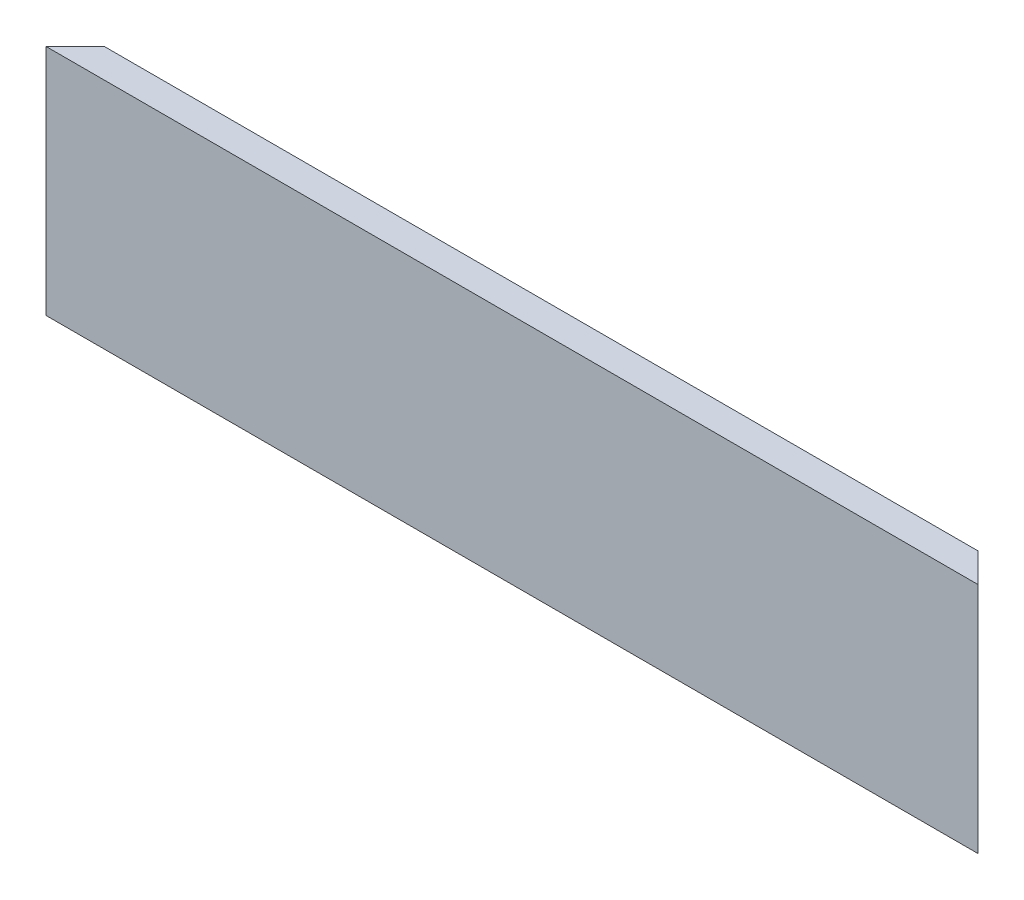
ISO-10303-21;
HEADER;
FILE_DESCRIPTION(('STEP AP214'),'2;1');
FILE_NAME('part.step','',(''),(''),'','','');
FILE_SCHEMA(('AUTOMOTIVE_DESIGN { 1 0 10303 214 1 1 1 1 }'));
ENDSEC;
DATA;
#1=APPLICATION_CONTEXT('core data for automotive mechanical design processes');
#2=APPLICATION_PROTOCOL_DEFINITION('international standard','automotive_design',2000,#1);
#3=PRODUCT_CONTEXT('',#1,'mechanical');
#4=PRODUCT('Part','Part','',(#3));
#5=PRODUCT_RELATED_PRODUCT_CATEGORY('part','',(#4));
#6=PRODUCT_DEFINITION_FORMATION('','',#4);
#7=PRODUCT_DEFINITION_CONTEXT('part definition',#1,'design');
#8=PRODUCT_DEFINITION('design','',#6,#7);
#9=PRODUCT_DEFINITION_SHAPE('','',#8);
#10=(LENGTH_UNIT() NAMED_UNIT(*) SI_UNIT(.MILLI.,.METRE.));
#11=(NAMED_UNIT(*) PLANE_ANGLE_UNIT() SI_UNIT($,.RADIAN.));
#12=(NAMED_UNIT(*) SI_UNIT($,.STERADIAN.) SOLID_ANGLE_UNIT());
#13=UNCERTAINTY_MEASURE_WITH_UNIT(LENGTH_MEASURE(1.E-05),#10,'distance_accuracy_value','');
#14=(GEOMETRIC_REPRESENTATION_CONTEXT(3) GLOBAL_UNCERTAINTY_ASSIGNED_CONTEXT((#13)) GLOBAL_UNIT_ASSIGNED_CONTEXT((#10,
#11,#12)) REPRESENTATION_CONTEXT('',''));
#15=CARTESIAN_POINT('',(0.,0.,0.));
#16=DIRECTION('',(0.,0.,1.));
#17=DIRECTION('',(1.,0.,0.));
#18=AXIS2_PLACEMENT_3D('',#15,#16,#17);
#19=CARTESIAN_POINT('',(50.8,0.,-25.4));
#20=DIRECTION('',(0.,1.,0.));
#21=DIRECTION('',(0.,0.,1.));
#22=AXIS2_PLACEMENT_3D('',#19,#20,#21);
#23=PLANE('',#22);
#24=DIRECTION('',(-1.,0.,0.));
#25=VECTOR('',#24,1.);
#26=CARTESIAN_POINT('',(50.8,0.,0.));
#27=LINE('',#26,#25);
#28=CARTESIAN_POINT('',(50.8,0.,0.));
#29=VERTEX_POINT('',#28);
#30=CARTESIAN_POINT('',(-50.8,0.,0.));
#31=VERTEX_POINT('',#30);
#32=EDGE_CURVE('E118',#29,#31,#27,.T.);
#33=ORIENTED_EDGE('',*,*,#32,.T.);
#34=DIRECTION('',(0.707106781186545,0.,-0.70710678118655));
#35=VECTOR('',#34,1.);
#36=CARTESIAN_POINT('',(12.6999999999997,0.,-63.5000000000001));
#37=LINE('',#36,#35);
#38=CARTESIAN_POINT('',(-25.4000000000002,0.,-25.4));
#39=VERTEX_POINT('',#38);
#40=EDGE_CURVE('E97',#31,#39,#37,.T.);
#41=ORIENTED_EDGE('',*,*,#40,.T.);
#42=DIRECTION('',(-1.,0.,0.));
#43=VECTOR('',#42,1.);
#44=CARTESIAN_POINT('',(50.8,0.,-25.4));
#45=LINE('',#44,#43);
#46=CARTESIAN_POINT('',(25.4000000000003,0.,-25.4));
#47=VERTEX_POINT('',#46);
#48=EDGE_CURVE('E11',#47,#39,#45,.T.);
#49=ORIENTED_EDGE('',*,*,#48,.F.);
#50=DIRECTION('',(0.707106781186544,0.,0.707106781186551));
#51=VECTOR('',#50,1.);
#52=CARTESIAN_POINT('',(38.1,0.,-12.7000000000001));
#53=LINE('',#52,#51);
#54=EDGE_CURVE('E104',#47,#29,#53,.T.);
#55=ORIENTED_EDGE('',*,*,#54,.T.);
#56=EDGE_LOOP('',(#33,#41,#49,#55));
#57=FACE_BOUND('',#56,.T.);
#58=ADVANCED_FACE('F43',(#57),#23,.F.);
#59=CARTESIAN_POINT('',(50.8,3.175,-25.4));
#60=DIRECTION('',(0.,0.,1.));
#61=DIRECTION('',(1.,0.,0.));
#62=AXIS2_PLACEMENT_3D('',#59,#60,#61);
#63=PLANE('',#62);
#64=ORIENTED_EDGE('',*,*,#48,.T.);
#65=DIRECTION('',(0.,1.,0.));
#66=VECTOR('',#65,1.);
#67=CARTESIAN_POINT('',(-25.4000000000002,-1.2E-05,-25.4));
#68=LINE('',#67,#66);
#69=CARTESIAN_POINT('',(-25.4000000000002,3.175,-25.4));
#70=VERTEX_POINT('',#69);
#71=EDGE_CURVE('E114',#39,#70,#68,.T.);
#72=ORIENTED_EDGE('',*,*,#71,.T.);
#73=DIRECTION('',(-1.,0.,0.));
#74=VECTOR('',#73,1.);
#75=CARTESIAN_POINT('',(50.8,3.175,-25.4));
#76=LINE('',#75,#74);
#77=CARTESIAN_POINT('',(25.4000000000003,3.175,-25.4));
#78=VERTEX_POINT('',#77);
#79=EDGE_CURVE('E52',#78,#70,#76,.T.);
#80=ORIENTED_EDGE('',*,*,#79,.F.);
#81=DIRECTION('',(0.,1.,0.));
#82=VECTOR('',#81,1.);
#83=CARTESIAN_POINT('',(25.4000000000003,-1.2E-05,-25.4));
#84=LINE('',#83,#82);
#85=EDGE_CURVE('E142',#47,#78,#84,.T.);
#86=ORIENTED_EDGE('',*,*,#85,.F.);
#87=EDGE_LOOP('',(#64,#72,#80,#86));
#88=FACE_BOUND('',#87,.T.);
#89=ADVANCED_FACE('F141',(#88),#63,.F.);
#90=CARTESIAN_POINT('',(50.8,3.175,-3.175));
#91=DIRECTION('',(0.,-1.,0.));
#92=DIRECTION('',(0.,0.,-1.));
#93=AXIS2_PLACEMENT_3D('',#90,#91,#92);
#94=PLANE('',#93);
#95=ORIENTED_EDGE('',*,*,#79,.T.);
#96=DIRECTION('',(-0.707106781186545,0.,0.70710678118655));
#97=VECTOR('',#96,1.);
#98=CARTESIAN_POINT('',(1.58749999999969,3.175,-52.3875));
#99=LINE('',#98,#97);
#100=CARTESIAN_POINT('',(-47.625,3.175,-3.175));
#101=VERTEX_POINT('',#100);
#102=EDGE_CURVE('E136',#70,#101,#99,.T.);
#103=ORIENTED_EDGE('',*,*,#102,.T.);
#104=DIRECTION('',(-1.,0.,0.));
#105=VECTOR('',#104,1.);
#106=CARTESIAN_POINT('',(50.8,3.175,-3.175));
#107=LINE('',#106,#105);
#108=CARTESIAN_POINT('',(47.625,3.175,-3.175));
#109=VERTEX_POINT('',#108);
#110=EDGE_CURVE('E122',#109,#101,#107,.T.);
#111=ORIENTED_EDGE('',*,*,#110,.F.);
#112=DIRECTION('',(-0.707106781186544,0.,-0.707106781186551));
#113=VECTOR('',#112,1.);
#114=CARTESIAN_POINT('',(49.2125,3.175,-1.58750000000002));
#115=LINE('',#114,#113);
#116=EDGE_CURVE('E137',#109,#78,#115,.T.);
#117=ORIENTED_EDGE('',*,*,#116,.T.);
#118=EDGE_LOOP('',(#95,#103,#111,#117));
#119=FACE_BOUND('',#118,.T.);
#120=ADVANCED_FACE('F134',(#119),#94,.F.);
#121=CARTESIAN_POINT('',(50.8,25.4,-3.175));
#122=DIRECTION('',(0.,0.,1.));
#123=DIRECTION('',(0.,-1.,0.));
#124=AXIS2_PLACEMENT_3D('',#121,#122,#123);
#125=PLANE('',#124);
#126=ORIENTED_EDGE('',*,*,#110,.T.);
#127=DIRECTION('',(0.,1.,0.));
#128=VECTOR('',#127,1.);
#129=CARTESIAN_POINT('',(-47.625,25.4,-3.175));
#130=LINE('',#129,#128);
#131=CARTESIAN_POINT('',(-47.625,25.4,-3.17500000000001));
#132=VERTEX_POINT('',#131);
#133=EDGE_CURVE('E145',#101,#132,#130,.T.);
#134=ORIENTED_EDGE('',*,*,#133,.T.);
#135=DIRECTION('',(-1.,0.,0.));
#136=VECTOR('',#135,1.);
#137=CARTESIAN_POINT('',(50.8,25.4,-3.175));
#138=LINE('',#137,#136);
#139=CARTESIAN_POINT('',(47.625,25.4,-3.17500000000001));
#140=VERTEX_POINT('',#139);
#141=EDGE_CURVE('E112',#140,#132,#138,.T.);
#142=ORIENTED_EDGE('',*,*,#141,.F.);
#143=DIRECTION('',(0.,-1.,0.));
#144=VECTOR('',#143,1.);
#145=CARTESIAN_POINT('',(47.625,25.4,-3.175));
#146=LINE('',#145,#144);
#147=EDGE_CURVE('E158',#140,#109,#146,.T.);
#148=ORIENTED_EDGE('',*,*,#147,.T.);
#149=EDGE_LOOP('',(#126,#134,#142,#148));
#150=FACE_BOUND('',#149,.T.);
#151=ADVANCED_FACE('F177',(#150),#125,.F.);
#152=CARTESIAN_POINT('',(50.8,25.4,0.));
#153=DIRECTION('',(0.,-1.,0.));
#154=DIRECTION('',(0.,0.,-1.));
#155=AXIS2_PLACEMENT_3D('',#152,#153,#154);
#156=PLANE('',#155);
#157=ORIENTED_EDGE('',*,*,#141,.T.);
#158=DIRECTION('',(0.707106781186545,0.,-0.70710678118655));
#159=VECTOR('',#158,1.);
#160=CARTESIAN_POINT('',(-50.8,25.4,0.));
#161=LINE('',#160,#159);
#162=CARTESIAN_POINT('',(-50.8,25.4,0.));
#163=VERTEX_POINT('',#162);
#164=EDGE_CURVE('E94',#163,#132,#161,.T.);
#165=ORIENTED_EDGE('',*,*,#164,.F.);
#166=DIRECTION('',(-1.,0.,0.));
#167=VECTOR('',#166,1.);
#168=CARTESIAN_POINT('',(50.8,25.4,0.));
#169=LINE('',#168,#167);
#170=CARTESIAN_POINT('',(50.8,25.4,0.));
#171=VERTEX_POINT('',#170);
#172=EDGE_CURVE('E109',#171,#163,#169,.T.);
#173=ORIENTED_EDGE('',*,*,#172,.F.);
#174=DIRECTION('',(0.707106781186544,0.,0.707106781186551));
#175=VECTOR('',#174,1.);
#176=CARTESIAN_POINT('',(25.4000000000003,25.4,-25.4));
#177=LINE('',#176,#175);
#178=EDGE_CURVE('E58',#140,#171,#177,.T.);
#179=ORIENTED_EDGE('',*,*,#178,.F.);
#180=EDGE_LOOP('',(#157,#165,#173,#179));
#181=FACE_BOUND('',#180,.T.);
#182=ADVANCED_FACE('F108',(#181),#156,.F.);
#183=CARTESIAN_POINT('',(50.8,0.,0.));
#184=DIRECTION('',(0.,0.,-1.));
#185=DIRECTION('',(-1.,0.,0.));
#186=AXIS2_PLACEMENT_3D('',#183,#184,#185);
#187=PLANE('',#186);
#188=DIRECTION('',(0.,-1.,0.));
#189=VECTOR('',#188,1.);
#190=CARTESIAN_POINT('',(-50.8,0.,0.));
#191=LINE('',#190,#189);
#192=EDGE_CURVE('E91',#163,#31,#191,.T.);
#193=ORIENTED_EDGE('',*,*,#192,.T.);
#194=ORIENTED_EDGE('',*,*,#32,.F.);
#195=DIRECTION('',(0.,-1.,0.));
#196=VECTOR('',#195,1.);
#197=CARTESIAN_POINT('',(50.8,0.,0.));
#198=LINE('',#197,#196);
#199=EDGE_CURVE('E103',#171,#29,#198,.T.);
#200=ORIENTED_EDGE('',*,*,#199,.F.);
#201=ORIENTED_EDGE('',*,*,#172,.T.);
#202=EDGE_LOOP('',(#193,#194,#200,#201));
#203=FACE_BOUND('',#202,.T.);
#204=ADVANCED_FACE('F116',(#203),#187,.F.);
#205=CARTESIAN_POINT('',(-50.8,-1.2E-05,0.));
#206=DIRECTION('',(0.70710678118655,0.,0.707106781186545));
#207=DIRECTION('',(0.707106781186545,0.,-0.70710678118655));
#208=AXIS2_PLACEMENT_3D('',#205,#206,#207);
#209=PLANE('',#208);
#210=ORIENTED_EDGE('',*,*,#192,.F.);
#211=ORIENTED_EDGE('',*,*,#164,.T.);
#212=ORIENTED_EDGE('',*,*,#133,.F.);
#213=ORIENTED_EDGE('',*,*,#102,.F.);
#214=ORIENTED_EDGE('',*,*,#71,.F.);
#215=ORIENTED_EDGE('',*,*,#40,.F.);
#216=EDGE_LOOP('',(#210,#211,#212,#213,#214,#215));
#217=FACE_BOUND('',#216,.T.);
#218=ADVANCED_FACE('F93',(#217),#209,.F.);
#219=CARTESIAN_POINT('',(25.4000000000003,-1.2E-05,-25.4));
#220=DIRECTION('',(-0.707106781186551,0.,0.707106781186544));
#221=DIRECTION('',(0.707106781186544,0.,0.707106781186551));
#222=AXIS2_PLACEMENT_3D('',#219,#220,#221);
#223=PLANE('',#222);
#224=ORIENTED_EDGE('',*,*,#85,.T.);
#225=ORIENTED_EDGE('',*,*,#116,.F.);
#226=ORIENTED_EDGE('',*,*,#147,.F.);
#227=ORIENTED_EDGE('',*,*,#178,.T.);
#228=ORIENTED_EDGE('',*,*,#199,.T.);
#229=ORIENTED_EDGE('',*,*,#54,.F.);
#230=EDGE_LOOP('',(#224,#225,#226,#227,#228,#229));
#231=FACE_BOUND('',#230,.T.);
#232=ADVANCED_FACE('F168',(#231),#223,.F.);
#233=CLOSED_SHELL('',(#58,#89,#120,#151,#182,#204,#218,#232));
#234=MANIFOLD_SOLID_BREP('B2',#233);
#235=ADVANCED_BREP_SHAPE_REPRESENTATION('',(#18,#234),#14);
#236=SHAPE_DEFINITION_REPRESENTATION(#9,#235);
ENDSEC;
END-ISO-10303-21;
